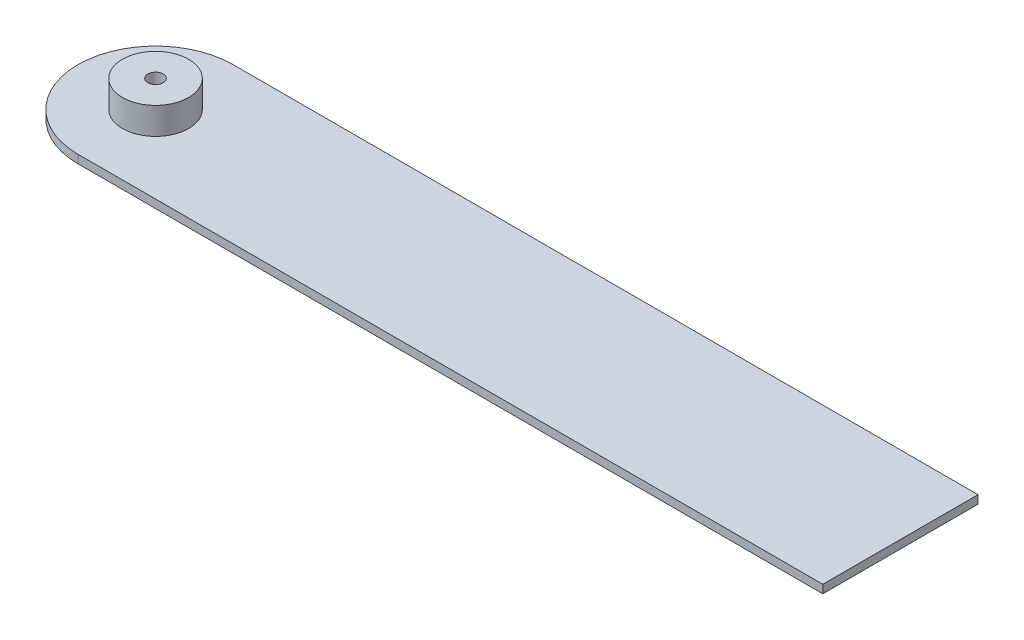
ISO-10303-21;
HEADER;
FILE_DESCRIPTION(('STEP AP214'),'2;1');
FILE_NAME('part.step','',(''),(''),'','','');
FILE_SCHEMA(('AUTOMOTIVE_DESIGN { 1 0 10303 214 1 1 1 1 }'));
ENDSEC;
DATA;
#1=APPLICATION_CONTEXT('core data for automotive mechanical design processes');
#2=APPLICATION_PROTOCOL_DEFINITION('international standard','automotive_design',2000,#1);
#3=PRODUCT_CONTEXT('',#1,'mechanical');
#4=PRODUCT('Part','Part','',(#3));
#5=PRODUCT_RELATED_PRODUCT_CATEGORY('part','',(#4));
#6=PRODUCT_DEFINITION_FORMATION('','',#4);
#7=PRODUCT_DEFINITION_CONTEXT('part definition',#1,'design');
#8=PRODUCT_DEFINITION('design','',#6,#7);
#9=PRODUCT_DEFINITION_SHAPE('','',#8);
#10=(LENGTH_UNIT() NAMED_UNIT(*) SI_UNIT(.MILLI.,.METRE.));
#11=(NAMED_UNIT(*) PLANE_ANGLE_UNIT() SI_UNIT($,.RADIAN.));
#12=(NAMED_UNIT(*) SI_UNIT($,.STERADIAN.) SOLID_ANGLE_UNIT());
#13=UNCERTAINTY_MEASURE_WITH_UNIT(LENGTH_MEASURE(1.E-05),#10,'distance_accuracy_value','');
#14=(GEOMETRIC_REPRESENTATION_CONTEXT(3) GLOBAL_UNCERTAINTY_ASSIGNED_CONTEXT((#13)) GLOBAL_UNIT_ASSIGNED_CONTEXT((#10,
#11,#12)) REPRESENTATION_CONTEXT('',''));
#15=CARTESIAN_POINT('',(0.,0.,0.));
#16=DIRECTION('',(0.,0.,1.));
#17=DIRECTION('',(1.,0.,0.));
#18=AXIS2_PLACEMENT_3D('',#15,#16,#17);
#19=CARTESIAN_POINT('',(0.,-3.6,0.));
#20=DIRECTION('',(0.,1.,0.));
#21=DIRECTION('',(0.,0.,1.));
#22=AXIS2_PLACEMENT_3D('',#19,#20,#21);
#23=CYLINDRICAL_SURFACE('',#22,0.74);
#24=CARTESIAN_POINT('',(0.,3.4,0.));
#25=DIRECTION('',(0.,1.,0.));
#26=DIRECTION('',(0.,0.,1.));
#27=AXIS2_PLACEMENT_3D('',#24,#25,#26);
#28=CIRCLE('',#27,0.74);
#29=CARTESIAN_POINT('',(0.,3.4,0.74));
#30=VERTEX_POINT('',#29);
#31=EDGE_CURVE('E125',#30,#30,#28,.T.);
#32=ORIENTED_EDGE('',*,*,#31,.T.);
#33=EDGE_LOOP('',(#32));
#34=FACE_BOUND('',#33,.T.);
#35=CARTESIAN_POINT('',(0.,0.4,0.));
#36=DIRECTION('',(0.,-1.,0.));
#37=DIRECTION('',(0.,0.,-1.));
#38=AXIS2_PLACEMENT_3D('',#35,#36,#37);
#39=CIRCLE('',#38,0.74);
#40=CARTESIAN_POINT('',(0.,0.4,-0.74));
#41=VERTEX_POINT('',#40);
#42=EDGE_CURVE('E11',#41,#41,#39,.F.);
#43=ORIENTED_EDGE('',*,*,#42,.F.);
#44=EDGE_LOOP('',(#43));
#45=FACE_BOUND('',#44,.T.);
#46=ADVANCED_FACE('F39',(#34,#45),#23,.F.);
#47=CARTESIAN_POINT('',(0.,2.,-7.5));
#48=DIRECTION('',(0.,0.,-1.));
#49=DIRECTION('',(-1.,0.,0.));
#50=AXIS2_PLACEMENT_3D('',#47,#48,#49);
#51=PLANE('',#50);
#52=DIRECTION('',(-1.,0.,0.));
#53=VECTOR('',#52,1.);
#54=CARTESIAN_POINT('',(72.,0.8,-7.5));
#55=LINE('',#54,#53);
#56=CARTESIAN_POINT('',(72.,0.8,-7.5));
#57=VERTEX_POINT('',#56);
#58=CARTESIAN_POINT('',(0.,0.8,-7.5));
#59=VERTEX_POINT('',#58);
#60=EDGE_CURVE('E82',#57,#59,#55,.T.);
#61=ORIENTED_EDGE('',*,*,#60,.F.);
#62=DIRECTION('',(0.,-1.,0.));
#63=VECTOR('',#62,1.);
#64=CARTESIAN_POINT('',(72.,2.,-7.5));
#65=LINE('',#64,#63);
#66=CARTESIAN_POINT('',(72.,0.,-7.5));
#67=VERTEX_POINT('',#66);
#68=EDGE_CURVE('E62',#57,#67,#65,.T.);
#69=ORIENTED_EDGE('',*,*,#68,.T.);
#70=DIRECTION('',(1.,0.,0.));
#71=VECTOR('',#70,1.);
#72=CARTESIAN_POINT('',(0.,0.,-7.5));
#73=LINE('',#72,#71);
#74=CARTESIAN_POINT('',(0.,0.,-7.5));
#75=VERTEX_POINT('',#74);
#76=EDGE_CURVE('E111',#75,#67,#73,.T.);
#77=ORIENTED_EDGE('',*,*,#76,.F.);
#78=DIRECTION('',(0.,-1.,0.));
#79=VECTOR('',#78,1.);
#80=CARTESIAN_POINT('',(0.,2.,-7.5));
#81=LINE('',#80,#79);
#82=EDGE_CURVE('E47',#59,#75,#81,.T.);
#83=ORIENTED_EDGE('',*,*,#82,.F.);
#84=EDGE_LOOP('',(#61,#69,#77,#83));
#85=FACE_BOUND('',#84,.T.);
#86=ADVANCED_FACE('F41',(#85),#51,.T.);
#87=CARTESIAN_POINT('',(0.,2.,0.));
#88=DIRECTION('',(0.,-1.,0.));
#89=DIRECTION('',(0.,0.,-1.));
#90=AXIS2_PLACEMENT_3D('',#87,#88,#89);
#91=CYLINDRICAL_SURFACE('',#90,7.5);
#92=DIRECTION('',(0.,-1.,0.));
#93=VECTOR('',#92,1.);
#94=CARTESIAN_POINT('',(0.,2.,7.5));
#95=LINE('',#94,#93);
#96=CARTESIAN_POINT('',(0.,0.8,7.5));
#97=VERTEX_POINT('',#96);
#98=CARTESIAN_POINT('',(0.,0.,7.5));
#99=VERTEX_POINT('',#98);
#100=EDGE_CURVE('E95',#97,#99,#95,.T.);
#101=ORIENTED_EDGE('',*,*,#100,.F.);
#102=CARTESIAN_POINT('',(0.,0.8,0.));
#103=DIRECTION('',(0.,-1.,0.));
#104=DIRECTION('',(0.,0.,-1.));
#105=AXIS2_PLACEMENT_3D('',#102,#103,#104);
#106=CIRCLE('',#105,7.5);
#107=EDGE_CURVE('E108',#97,#59,#106,.T.);
#108=ORIENTED_EDGE('',*,*,#107,.T.);
#109=ORIENTED_EDGE('',*,*,#82,.T.);
#110=CARTESIAN_POINT('',(0.,0.,0.));
#111=DIRECTION('',(0.,1.,0.));
#112=DIRECTION('',(0.,0.,1.));
#113=AXIS2_PLACEMENT_3D('',#110,#111,#112);
#114=CIRCLE('',#113,7.5);
#115=EDGE_CURVE('E106',#75,#99,#114,.T.);
#116=ORIENTED_EDGE('',*,*,#115,.T.);
#117=EDGE_LOOP('',(#101,#108,#109,#116));
#118=FACE_BOUND('',#117,.T.);
#119=ADVANCED_FACE('F105',(#118),#91,.T.);
#120=CARTESIAN_POINT('',(0.,2.,7.5));
#121=DIRECTION('',(0.,0.,-1.));
#122=DIRECTION('',(-1.,0.,0.));
#123=AXIS2_PLACEMENT_3D('',#120,#121,#122);
#124=PLANE('',#123);
#125=DIRECTION('',(0.,-1.,0.));
#126=VECTOR('',#125,1.);
#127=CARTESIAN_POINT('',(72.,2.,7.5));
#128=LINE('',#127,#126);
#129=CARTESIAN_POINT('',(72.,0.8,7.5));
#130=VERTEX_POINT('',#129);
#131=CARTESIAN_POINT('',(72.,0.,7.5));
#132=VERTEX_POINT('',#131);
#133=EDGE_CURVE('E93',#130,#132,#128,.T.);
#134=ORIENTED_EDGE('',*,*,#133,.F.);
#135=DIRECTION('',(1.,0.,0.));
#136=VECTOR('',#135,1.);
#137=CARTESIAN_POINT('',(72.,0.8,7.5));
#138=LINE('',#137,#136);
#139=EDGE_CURVE('E54',#97,#130,#138,.T.);
#140=ORIENTED_EDGE('',*,*,#139,.F.);
#141=ORIENTED_EDGE('',*,*,#100,.T.);
#142=DIRECTION('',(1.,0.,0.));
#143=VECTOR('',#142,1.);
#144=CARTESIAN_POINT('',(0.,0.,7.5));
#145=LINE('',#144,#143);
#146=EDGE_CURVE('E97',#99,#132,#145,.T.);
#147=ORIENTED_EDGE('',*,*,#146,.T.);
#148=EDGE_LOOP('',(#134,#140,#141,#147));
#149=FACE_BOUND('',#148,.T.);
#150=ADVANCED_FACE('F118',(#149),#124,.F.);
#151=CARTESIAN_POINT('',(72.,2.,0.));
#152=DIRECTION('',(-1.,0.,0.));
#153=DIRECTION('',(0.,0.,1.));
#154=AXIS2_PLACEMENT_3D('',#151,#152,#153);
#155=PLANE('',#154);
#156=ORIENTED_EDGE('',*,*,#68,.F.);
#157=DIRECTION('',(0.,0.,-1.));
#158=VECTOR('',#157,1.);
#159=CARTESIAN_POINT('',(72.,0.8,-7.5));
#160=LINE('',#159,#158);
#161=EDGE_CURVE('E80',#130,#57,#160,.T.);
#162=ORIENTED_EDGE('',*,*,#161,.F.);
#163=ORIENTED_EDGE('',*,*,#133,.T.);
#164=DIRECTION('',(0.,0.,-1.));
#165=VECTOR('',#164,1.);
#166=CARTESIAN_POINT('',(72.,0.,0.));
#167=LINE('',#166,#165);
#168=EDGE_CURVE('E91',#132,#67,#167,.T.);
#169=ORIENTED_EDGE('',*,*,#168,.T.);
#170=EDGE_LOOP('',(#156,#162,#163,#169));
#171=FACE_BOUND('',#170,.T.);
#172=ADVANCED_FACE('F89',(#171),#155,.F.);
#173=CARTESIAN_POINT('',(0.,0.,0.));
#174=DIRECTION('',(0.,1.,0.));
#175=DIRECTION('',(0.,0.,1.));
#176=AXIS2_PLACEMENT_3D('',#173,#174,#175);
#177=PLANE('',#176);
#178=ORIENTED_EDGE('',*,*,#76,.T.);
#179=ORIENTED_EDGE('',*,*,#168,.F.);
#180=ORIENTED_EDGE('',*,*,#146,.F.);
#181=ORIENTED_EDGE('',*,*,#115,.F.);
#182=EDGE_LOOP('',(#178,#179,#180,#181));
#183=FACE_BOUND('',#182,.T.);
#184=ADVANCED_FACE('F110',(#183),#177,.F.);
#185=CARTESIAN_POINT('',(0.,0.8,0.));
#186=DIRECTION('',(0.,-1.,0.));
#187=DIRECTION('',(0.,0.,-1.));
#188=AXIS2_PLACEMENT_3D('',#185,#186,#187);
#189=PLANE('',#188);
#190=CARTESIAN_POINT('',(0.,0.8,0.));
#191=DIRECTION('',(0.,1.,0.));
#192=DIRECTION('',(0.,0.,1.));
#193=AXIS2_PLACEMENT_3D('',#190,#191,#192);
#194=CIRCLE('',#193,3.2);
#195=CARTESIAN_POINT('',(0.,0.8,3.2));
#196=VERTEX_POINT('',#195);
#197=EDGE_CURVE('E86',#196,#196,#194,.T.);
#198=ORIENTED_EDGE('',*,*,#197,.F.);
#199=EDGE_LOOP('',(#198));
#200=FACE_BOUND('',#199,.T.);
#201=ORIENTED_EDGE('',*,*,#139,.T.);
#202=ORIENTED_EDGE('',*,*,#161,.T.);
#203=ORIENTED_EDGE('',*,*,#60,.T.);
#204=ORIENTED_EDGE('',*,*,#107,.F.);
#205=EDGE_LOOP('',(#201,#202,#203,#204));
#206=FACE_BOUND('',#205,.T.);
#207=ADVANCED_FACE('F81',(#200,#206),#189,.F.);
#208=CARTESIAN_POINT('',(0.,0.8,0.));
#209=DIRECTION('',(0.,1.,0.));
#210=DIRECTION('',(0.,0.,1.));
#211=AXIS2_PLACEMENT_3D('',#208,#209,#210);
#212=CYLINDRICAL_SURFACE('',#211,3.2);
#213=ORIENTED_EDGE('',*,*,#197,.T.);
#214=EDGE_LOOP('',(#213));
#215=FACE_BOUND('',#214,.T.);
#216=CARTESIAN_POINT('',(0.,3.4,0.));
#217=DIRECTION('',(0.,1.,0.));
#218=DIRECTION('',(0.,0.,1.));
#219=AXIS2_PLACEMENT_3D('',#216,#217,#218);
#220=CIRCLE('',#219,3.2);
#221=CARTESIAN_POINT('',(0.,3.4,3.2));
#222=VERTEX_POINT('',#221);
#223=EDGE_CURVE('E122',#222,#222,#220,.T.);
#224=ORIENTED_EDGE('',*,*,#223,.F.);
#225=EDGE_LOOP('',(#224));
#226=FACE_BOUND('',#225,.T.);
#227=ADVANCED_FACE('F134',(#215,#226),#212,.T.);
#228=CARTESIAN_POINT('',(0.,3.4,0.));
#229=DIRECTION('',(0.,1.,0.));
#230=DIRECTION('',(0.,0.,1.));
#231=AXIS2_PLACEMENT_3D('',#228,#229,#230);
#232=PLANE('',#231);
#233=ORIENTED_EDGE('',*,*,#223,.T.);
#234=EDGE_LOOP('',(#233));
#235=FACE_BOUND('',#234,.T.);
#236=ORIENTED_EDGE('',*,*,#31,.F.);
#237=EDGE_LOOP('',(#236));
#238=FACE_BOUND('',#237,.T.);
#239=ADVANCED_FACE('F131',(#235,#238),#232,.T.);
#240=CARTESIAN_POINT('',(0.,0.4,0.));
#241=DIRECTION('',(0.,-1.,0.));
#242=DIRECTION('',(0.,0.,-1.));
#243=AXIS2_PLACEMENT_3D('',#240,#241,#242);
#244=PLANE('',#243);
#245=ORIENTED_EDGE('',*,*,#42,.T.);
#246=EDGE_LOOP('',(#245));
#247=FACE_BOUND('',#246,.T.);
#248=ADVANCED_FACE('F133',(#247),#244,.F.);
#249=CLOSED_SHELL('',(#46,#86,#119,#150,#172,#184,#207,#227,#239,#248));
#250=MANIFOLD_SOLID_BREP('B2',#249);
#251=ADVANCED_BREP_SHAPE_REPRESENTATION('',(#18,#250),#14);
#252=SHAPE_DEFINITION_REPRESENTATION(#9,#251);
ENDSEC;
END-ISO-10303-21;
